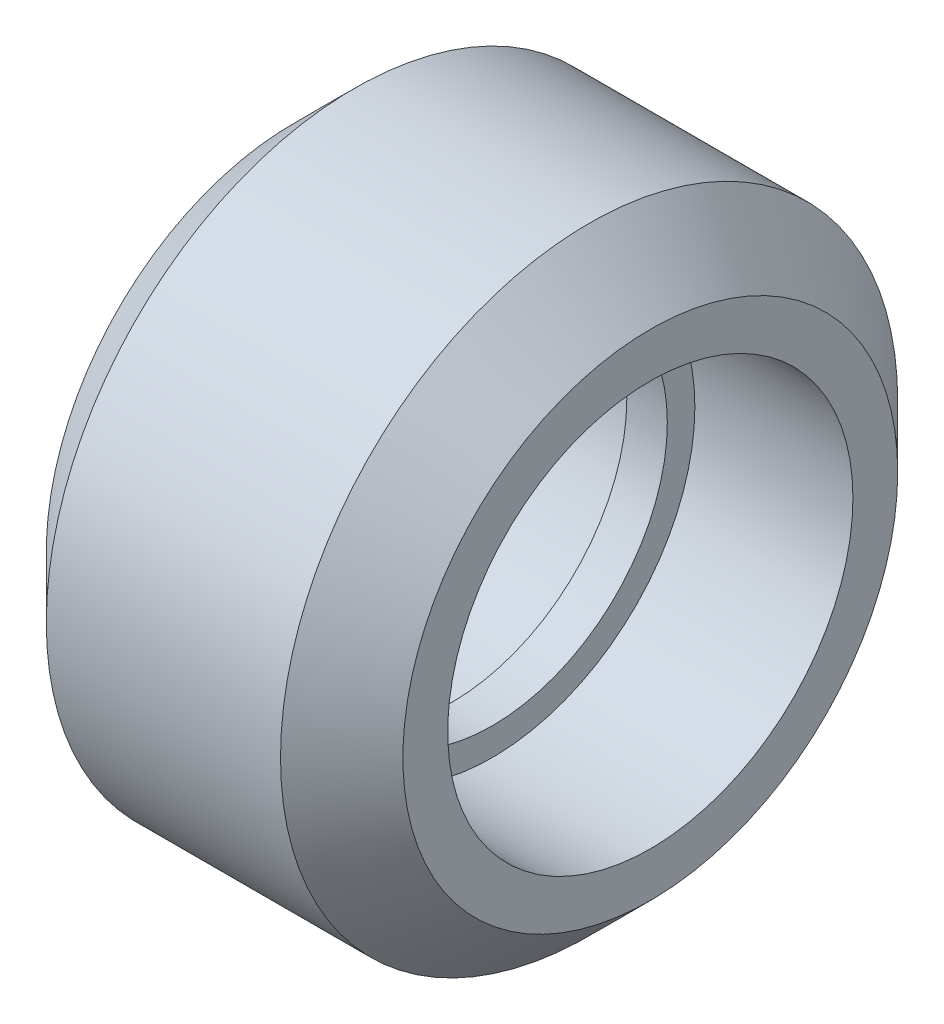
ISO-10303-21;
HEADER;
FILE_DESCRIPTION(('STEP AP214'),'2;1');
FILE_NAME('part.step','',(''),(''),'','','');
FILE_SCHEMA(('AUTOMOTIVE_DESIGN { 1 0 10303 214 1 1 1 1 }'));
ENDSEC;
DATA;
#1=APPLICATION_CONTEXT('core data for automotive mechanical design processes');
#2=APPLICATION_PROTOCOL_DEFINITION('international standard','automotive_design',2000,#1);
#3=PRODUCT_CONTEXT('',#1,'mechanical');
#4=PRODUCT('Part','Part','',(#3));
#5=PRODUCT_RELATED_PRODUCT_CATEGORY('part','',(#4));
#6=PRODUCT_DEFINITION_FORMATION('','',#4);
#7=PRODUCT_DEFINITION_CONTEXT('part definition',#1,'design');
#8=PRODUCT_DEFINITION('design','',#6,#7);
#9=PRODUCT_DEFINITION_SHAPE('','',#8);
#10=(LENGTH_UNIT() NAMED_UNIT(*) SI_UNIT(.MILLI.,.METRE.));
#11=(NAMED_UNIT(*) PLANE_ANGLE_UNIT() SI_UNIT($,.RADIAN.));
#12=(NAMED_UNIT(*) SI_UNIT($,.STERADIAN.) SOLID_ANGLE_UNIT());
#13=UNCERTAINTY_MEASURE_WITH_UNIT(LENGTH_MEASURE(1.E-05),#10,'distance_accuracy_value','');
#14=(GEOMETRIC_REPRESENTATION_CONTEXT(3) GLOBAL_UNCERTAINTY_ASSIGNED_CONTEXT((#13)) GLOBAL_UNIT_ASSIGNED_CONTEXT((#10,
#11,#12)) REPRESENTATION_CONTEXT('',''));
#15=CARTESIAN_POINT('',(0.,0.,0.));
#16=DIRECTION('',(0.,0.,1.));
#17=DIRECTION('',(1.,0.,0.));
#18=AXIS2_PLACEMENT_3D('',#15,#16,#17);
#19=CARTESIAN_POINT('',(-0.5,4.32,0.));
#20=DIRECTION('',(-1.,0.,0.));
#21=DIRECTION('',(0.,0.,1.));
#22=AXIS2_PLACEMENT_3D('',#19,#20,#21);
#23=PLANE('',#22);
#24=CARTESIAN_POINT('',(-0.5,0.,0.));
#25=DIRECTION('',(1.,0.,0.));
#26=DIRECTION('',(0.,0.,-1.));
#27=AXIS2_PLACEMENT_3D('',#24,#25,#26);
#28=CIRCLE('',#27,4.32);
#29=CARTESIAN_POINT('',(-0.5,0.,-4.32));
#30=VERTEX_POINT('',#29);
#31=EDGE_CURVE('E10',#30,#30,#28,.T.);
#32=ORIENTED_EDGE('',*,*,#31,.T.);
#33=EDGE_LOOP('',(#32));
#34=FACE_BOUND('',#33,.T.);
#35=CARTESIAN_POINT('',(-0.5,0.,0.));
#36=DIRECTION('',(1.,0.,0.));
#37=DIRECTION('',(0.,0.,-1.));
#38=AXIS2_PLACEMENT_3D('',#35,#36,#37);
#39=CIRCLE('',#38,5.);
#40=CARTESIAN_POINT('',(-0.5,0.,-5.));
#41=VERTEX_POINT('',#40);
#42=EDGE_CURVE('E66',#41,#41,#39,.T.);
#43=ORIENTED_EDGE('',*,*,#42,.F.);
#44=EDGE_LOOP('',(#43));
#45=FACE_BOUND('',#44,.T.);
#46=ADVANCED_FACE('F32',(#34,#45),#23,.T.);
#47=CARTESIAN_POINT('',(0.,0.,0.));
#48=DIRECTION('',(1.,0.,0.));
#49=DIRECTION('',(0.,0.,-1.));
#50=AXIS2_PLACEMENT_3D('',#47,#48,#49);
#51=CYLINDRICAL_SURFACE('',#50,4.32);
#52=CARTESIAN_POINT('',(0.5,0.,0.));
#53=DIRECTION('',(1.,0.,0.));
#54=DIRECTION('',(0.,0.,-1.));
#55=AXIS2_PLACEMENT_3D('',#52,#53,#54);
#56=CIRCLE('',#55,4.32);
#57=CARTESIAN_POINT('',(0.5,0.,-4.32));
#58=VERTEX_POINT('',#57);
#59=EDGE_CURVE('E38',#58,#58,#56,.T.);
#60=ORIENTED_EDGE('',*,*,#59,.T.);
#61=EDGE_LOOP('',(#60));
#62=FACE_BOUND('',#61,.T.);
#63=ORIENTED_EDGE('',*,*,#31,.F.);
#64=EDGE_LOOP('',(#63));
#65=FACE_BOUND('',#64,.T.);
#66=ADVANCED_FACE('F74',(#62,#65),#51,.F.);
#67=CARTESIAN_POINT('',(0.5,4.32,0.));
#68=DIRECTION('',(1.,0.,0.));
#69=DIRECTION('',(0.,0.,-1.));
#70=AXIS2_PLACEMENT_3D('',#67,#68,#69);
#71=PLANE('',#70);
#72=CARTESIAN_POINT('',(0.5,0.,0.));
#73=DIRECTION('',(1.,0.,0.));
#74=DIRECTION('',(0.,0.,-1.));
#75=AXIS2_PLACEMENT_3D('',#72,#73,#74);
#76=CIRCLE('',#75,5.);
#77=CARTESIAN_POINT('',(0.5,0.,-5.));
#78=VERTEX_POINT('',#77);
#79=EDGE_CURVE('E42',#78,#78,#76,.T.);
#80=ORIENTED_EDGE('',*,*,#79,.T.);
#81=EDGE_LOOP('',(#80));
#82=FACE_BOUND('',#81,.T.);
#83=ORIENTED_EDGE('',*,*,#59,.F.);
#84=EDGE_LOOP('',(#83));
#85=FACE_BOUND('',#84,.T.);
#86=ADVANCED_FACE('F78',(#82,#85),#71,.T.);
#87=CARTESIAN_POINT('',(0.,0.,0.));
#88=DIRECTION('',(1.,0.,0.));
#89=DIRECTION('',(0.,0.,-1.));
#90=AXIS2_PLACEMENT_3D('',#87,#88,#89);
#91=CYLINDRICAL_SURFACE('',#90,5.);
#92=CARTESIAN_POINT('',(4.4,0.,0.));
#93=DIRECTION('',(1.,0.,0.));
#94=DIRECTION('',(0.,0.,-1.));
#95=AXIS2_PLACEMENT_3D('',#92,#93,#94);
#96=CIRCLE('',#95,5.);
#97=CARTESIAN_POINT('',(4.4,0.,-5.));
#98=VERTEX_POINT('',#97);
#99=EDGE_CURVE('E46',#98,#98,#96,.T.);
#100=ORIENTED_EDGE('',*,*,#99,.T.);
#101=EDGE_LOOP('',(#100));
#102=FACE_BOUND('',#101,.T.);
#103=ORIENTED_EDGE('',*,*,#79,.F.);
#104=EDGE_LOOP('',(#103));
#105=FACE_BOUND('',#104,.T.);
#106=ADVANCED_FACE('F82',(#102,#105),#91,.F.);
#107=CARTESIAN_POINT('',(4.4,5.,0.));
#108=DIRECTION('',(1.,0.,0.));
#109=DIRECTION('',(0.,0.,-1.));
#110=AXIS2_PLACEMENT_3D('',#107,#108,#109);
#111=PLANE('',#110);
#112=CARTESIAN_POINT('',(4.4,0.,0.));
#113=DIRECTION('',(1.,0.,0.));
#114=DIRECTION('',(0.,0.,-1.));
#115=AXIS2_PLACEMENT_3D('',#112,#113,#114);
#116=CIRCLE('',#115,6.10500000000001);
#117=CARTESIAN_POINT('',(4.4,0.,-6.10500000000001));
#118=VERTEX_POINT('',#117);
#119=EDGE_CURVE('E51',#118,#118,#116,.T.);
#120=ORIENTED_EDGE('',*,*,#119,.T.);
#121=EDGE_LOOP('',(#120));
#122=FACE_BOUND('',#121,.T.);
#123=ORIENTED_EDGE('',*,*,#99,.F.);
#124=EDGE_LOOP('',(#123));
#125=FACE_BOUND('',#124,.T.);
#126=ADVANCED_FACE('F89',(#122,#125),#111,.T.);
#127=CARTESIAN_POINT('',(4.4,0.,0.));
#128=DIRECTION('',(-1.,0.,0.));
#129=DIRECTION('',(0.,0.,1.));
#130=AXIS2_PLACEMENT_3D('',#127,#128,#129);
#131=CONICAL_SURFACE('',#130,6.10500000000001,0.785398163397447);
#132=CARTESIAN_POINT('',(2.89,0.,0.));
#133=DIRECTION('',(1.,0.,0.));
#134=DIRECTION('',(0.,0.,-1.));
#135=AXIS2_PLACEMENT_3D('',#132,#133,#134);
#136=CIRCLE('',#135,7.615);
#137=CARTESIAN_POINT('',(2.89,0.,-7.615));
#138=VERTEX_POINT('',#137);
#139=EDGE_CURVE('E54',#138,#138,#136,.T.);
#140=ORIENTED_EDGE('',*,*,#139,.T.);
#141=EDGE_LOOP('',(#140));
#142=FACE_BOUND('',#141,.T.);
#143=ORIENTED_EDGE('',*,*,#119,.F.);
#144=EDGE_LOOP('',(#143));
#145=FACE_BOUND('',#144,.T.);
#146=ADVANCED_FACE('F93',(#142,#145),#131,.T.);
#147=CARTESIAN_POINT('',(0.,0.,0.));
#148=DIRECTION('',(1.,0.,0.));
#149=DIRECTION('',(0.,0.,-1.));
#150=AXIS2_PLACEMENT_3D('',#147,#148,#149);
#151=CYLINDRICAL_SURFACE('',#150,7.615);
#152=CARTESIAN_POINT('',(-2.89,0.,0.));
#153=DIRECTION('',(1.,0.,0.));
#154=DIRECTION('',(0.,0.,-1.));
#155=AXIS2_PLACEMENT_3D('',#152,#153,#154);
#156=CIRCLE('',#155,7.615);
#157=CARTESIAN_POINT('',(-2.89,0.,-7.615));
#158=VERTEX_POINT('',#157);
#159=EDGE_CURVE('E57',#158,#158,#156,.T.);
#160=ORIENTED_EDGE('',*,*,#159,.T.);
#161=EDGE_LOOP('',(#160));
#162=FACE_BOUND('',#161,.T.);
#163=ORIENTED_EDGE('',*,*,#139,.F.);
#164=EDGE_LOOP('',(#163));
#165=FACE_BOUND('',#164,.T.);
#166=ADVANCED_FACE('F97',(#162,#165),#151,.T.);
#167=CARTESIAN_POINT('',(-2.89,0.,0.));
#168=DIRECTION('',(1.,0.,0.));
#169=DIRECTION('',(0.,0.,-1.));
#170=AXIS2_PLACEMENT_3D('',#167,#168,#169);
#171=CONICAL_SURFACE('',#170,7.615,0.785398163397447);
#172=CARTESIAN_POINT('',(-4.4,0.,0.));
#173=DIRECTION('',(1.,0.,0.));
#174=DIRECTION('',(0.,0.,-1.));
#175=AXIS2_PLACEMENT_3D('',#172,#173,#174);
#176=CIRCLE('',#175,6.105);
#177=CARTESIAN_POINT('',(-4.4,0.,-6.105));
#178=VERTEX_POINT('',#177);
#179=EDGE_CURVE('E60',#178,#178,#176,.T.);
#180=ORIENTED_EDGE('',*,*,#179,.T.);
#181=EDGE_LOOP('',(#180));
#182=FACE_BOUND('',#181,.T.);
#183=ORIENTED_EDGE('',*,*,#159,.F.);
#184=EDGE_LOOP('',(#183));
#185=FACE_BOUND('',#184,.T.);
#186=ADVANCED_FACE('F101',(#182,#185),#171,.T.);
#187=CARTESIAN_POINT('',(-4.4,5.,0.));
#188=DIRECTION('',(-1.,0.,0.));
#189=DIRECTION('',(0.,0.,1.));
#190=AXIS2_PLACEMENT_3D('',#187,#188,#189);
#191=PLANE('',#190);
#192=CARTESIAN_POINT('',(-4.4,0.,0.));
#193=DIRECTION('',(1.,0.,0.));
#194=DIRECTION('',(0.,0.,-1.));
#195=AXIS2_PLACEMENT_3D('',#192,#193,#194);
#196=CIRCLE('',#195,5.);
#197=CARTESIAN_POINT('',(-4.4,0.,-5.));
#198=VERTEX_POINT('',#197);
#199=EDGE_CURVE('E63',#198,#198,#196,.T.);
#200=ORIENTED_EDGE('',*,*,#199,.T.);
#201=EDGE_LOOP('',(#200));
#202=FACE_BOUND('',#201,.T.);
#203=ORIENTED_EDGE('',*,*,#179,.F.);
#204=EDGE_LOOP('',(#203));
#205=FACE_BOUND('',#204,.T.);
#206=ADVANCED_FACE('F105',(#202,#205),#191,.T.);
#207=CARTESIAN_POINT('',(0.,0.,0.));
#208=DIRECTION('',(1.,0.,0.));
#209=DIRECTION('',(0.,0.,-1.));
#210=AXIS2_PLACEMENT_3D('',#207,#208,#209);
#211=CYLINDRICAL_SURFACE('',#210,5.);
#212=ORIENTED_EDGE('',*,*,#42,.T.);
#213=EDGE_LOOP('',(#212));
#214=FACE_BOUND('',#213,.T.);
#215=ORIENTED_EDGE('',*,*,#199,.F.);
#216=EDGE_LOOP('',(#215));
#217=FACE_BOUND('',#216,.T.);
#218=ADVANCED_FACE('F70',(#214,#217),#211,.F.);
#219=CLOSED_SHELL('',(#46,#66,#86,#106,#126,#146,#166,#186,#206,#218));
#220=MANIFOLD_SOLID_BREP('B2',#219);
#221=ADVANCED_BREP_SHAPE_REPRESENTATION('',(#18,#220),#14);
#222=SHAPE_DEFINITION_REPRESENTATION(#9,#221);
ENDSEC;
END-ISO-10303-21;
